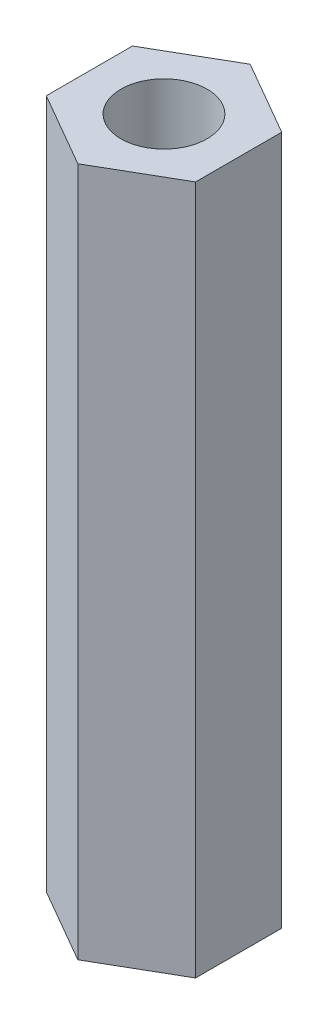
ISO-10303-21;
HEADER;
FILE_DESCRIPTION(('STEP AP214'),'2;1');
FILE_NAME('part.step','',(''),(''),'','','');
FILE_SCHEMA(('AUTOMOTIVE_DESIGN { 1 0 10303 214 1 1 1 1 }'));
ENDSEC;
DATA;
#1=APPLICATION_CONTEXT('core data for automotive mechanical design processes');
#2=APPLICATION_PROTOCOL_DEFINITION('international standard','automotive_design',2000,#1);
#3=PRODUCT_CONTEXT('',#1,'mechanical');
#4=PRODUCT('Part','Part','',(#3));
#5=PRODUCT_RELATED_PRODUCT_CATEGORY('part','',(#4));
#6=PRODUCT_DEFINITION_FORMATION('','',#4);
#7=PRODUCT_DEFINITION_CONTEXT('part definition',#1,'design');
#8=PRODUCT_DEFINITION('design','',#6,#7);
#9=PRODUCT_DEFINITION_SHAPE('','',#8);
#10=(LENGTH_UNIT() NAMED_UNIT(*) SI_UNIT(.MILLI.,.METRE.));
#11=(NAMED_UNIT(*) PLANE_ANGLE_UNIT() SI_UNIT($,.RADIAN.));
#12=(NAMED_UNIT(*) SI_UNIT($,.STERADIAN.) SOLID_ANGLE_UNIT());
#13=UNCERTAINTY_MEASURE_WITH_UNIT(LENGTH_MEASURE(1.E-05),#10,'distance_accuracy_value','');
#14=(GEOMETRIC_REPRESENTATION_CONTEXT(3) GLOBAL_UNCERTAINTY_ASSIGNED_CONTEXT((#13)) GLOBAL_UNIT_ASSIGNED_CONTEXT((#10,
#11,#12)) REPRESENTATION_CONTEXT('',''));
#15=CARTESIAN_POINT('',(0.,0.,0.));
#16=DIRECTION('',(0.,0.,1.));
#17=DIRECTION('',(1.,0.,0.));
#18=AXIS2_PLACEMENT_3D('',#15,#16,#17);
#19=CARTESIAN_POINT('',(0.,40.,-5.));
#20=DIRECTION('',(0.,1.,0.));
#21=DIRECTION('',(0.,0.,1.));
#22=AXIS2_PLACEMENT_3D('',#19,#20,#21);
#23=PLANE('',#22);
#24=DIRECTION('',(-0.866025403784439,0.,-0.5));
#25=VECTOR('',#24,1.);
#26=CARTESIAN_POINT('',(4.33012701892219,40.,-2.5));
#27=LINE('',#26,#25);
#28=CARTESIAN_POINT('',(4.33012701892219,40.,-2.5));
#29=VERTEX_POINT('',#28);
#30=CARTESIAN_POINT('',(0.,40.,-5.));
#31=VERTEX_POINT('',#30);
#32=EDGE_CURVE('E127',#29,#31,#27,.T.);
#33=ORIENTED_EDGE('',*,*,#32,.T.);
#34=DIRECTION('',(-0.866025403784439,0.,0.5));
#35=VECTOR('',#34,1.);
#36=CARTESIAN_POINT('',(0.,40.,-5.));
#37=LINE('',#36,#35);
#38=CARTESIAN_POINT('',(-4.33012701892219,40.,-2.5));
#39=VERTEX_POINT('',#38);
#40=EDGE_CURVE('E85',#31,#39,#37,.T.);
#41=ORIENTED_EDGE('',*,*,#40,.T.);
#42=DIRECTION('',(0.,0.,1.));
#43=VECTOR('',#42,1.);
#44=CARTESIAN_POINT('',(-4.33012701892219,40.,-2.5));
#45=LINE('',#44,#43);
#46=CARTESIAN_POINT('',(-4.33012701892219,40.,2.5));
#47=VERTEX_POINT('',#46);
#48=EDGE_CURVE('E98',#39,#47,#45,.T.);
#49=ORIENTED_EDGE('',*,*,#48,.T.);
#50=DIRECTION('',(0.866025403784439,0.,0.5));
#51=VECTOR('',#50,1.);
#52=CARTESIAN_POINT('',(-4.33012701892219,40.,2.5));
#53=LINE('',#52,#51);
#54=CARTESIAN_POINT('',(0.,40.,5.));
#55=VERTEX_POINT('',#54);
#56=EDGE_CURVE('E92',#47,#55,#53,.T.);
#57=ORIENTED_EDGE('',*,*,#56,.T.);
#58=DIRECTION('',(0.866025403784439,0.,-0.5));
#59=VECTOR('',#58,1.);
#60=CARTESIAN_POINT('',(0.,40.,5.));
#61=LINE('',#60,#59);
#62=CARTESIAN_POINT('',(4.33012701892219,40.,2.5));
#63=VERTEX_POINT('',#62);
#64=EDGE_CURVE('E96',#55,#63,#61,.T.);
#65=ORIENTED_EDGE('',*,*,#64,.T.);
#66=DIRECTION('',(0.,0.,-1.));
#67=VECTOR('',#66,1.);
#68=CARTESIAN_POINT('',(4.33012701892219,40.,2.5));
#69=LINE('',#68,#67);
#70=EDGE_CURVE('E48',#63,#29,#69,.T.);
#71=ORIENTED_EDGE('',*,*,#70,.T.);
#72=EDGE_LOOP('',(#33,#41,#49,#57,#65,#71));
#73=FACE_BOUND('',#72,.T.);
#74=CARTESIAN_POINT('',(0.,40.,0.));
#75=DIRECTION('',(0.,1.,0.));
#76=DIRECTION('',(0.,0.,1.));
#77=AXIS2_PLACEMENT_3D('',#74,#75,#76);
#78=CIRCLE('',#77,2.5);
#79=CARTESIAN_POINT('',(0.,40.,2.5));
#80=VERTEX_POINT('',#79);
#81=EDGE_CURVE('E120',#80,#80,#78,.T.);
#82=ORIENTED_EDGE('',*,*,#81,.F.);
#83=EDGE_LOOP('',(#82));
#84=FACE_BOUND('',#83,.T.);
#85=ADVANCED_FACE('F31',(#73,#84),#23,.T.);
#86=CARTESIAN_POINT('',(0.,0.,-5.));
#87=DIRECTION('',(0.,1.,0.));
#88=DIRECTION('',(0.,0.,1.));
#89=AXIS2_PLACEMENT_3D('',#86,#87,#88);
#90=PLANE('',#89);
#91=DIRECTION('',(-0.866025403784439,0.,-0.5));
#92=VECTOR('',#91,1.);
#93=CARTESIAN_POINT('',(4.33012701892219,0.,-2.5));
#94=LINE('',#93,#92);
#95=CARTESIAN_POINT('',(4.33012701892219,0.,-2.5));
#96=VERTEX_POINT('',#95);
#97=CARTESIAN_POINT('',(0.,0.,-5.));
#98=VERTEX_POINT('',#97);
#99=EDGE_CURVE('E116',#96,#98,#94,.T.);
#100=ORIENTED_EDGE('',*,*,#99,.F.);
#101=DIRECTION('',(0.,0.,-1.));
#102=VECTOR('',#101,1.);
#103=CARTESIAN_POINT('',(4.33012701892219,0.,2.5));
#104=LINE('',#103,#102);
#105=CARTESIAN_POINT('',(4.33012701892219,0.,2.5));
#106=VERTEX_POINT('',#105);
#107=EDGE_CURVE('E77',#106,#96,#104,.T.);
#108=ORIENTED_EDGE('',*,*,#107,.F.);
#109=DIRECTION('',(0.866025403784439,0.,-0.5));
#110=VECTOR('',#109,1.);
#111=CARTESIAN_POINT('',(0.,0.,5.));
#112=LINE('',#111,#110);
#113=CARTESIAN_POINT('',(0.,0.,5.));
#114=VERTEX_POINT('',#113);
#115=EDGE_CURVE('E71',#114,#106,#112,.T.);
#116=ORIENTED_EDGE('',*,*,#115,.F.);
#117=DIRECTION('',(0.866025403784439,0.,0.5));
#118=VECTOR('',#117,1.);
#119=CARTESIAN_POINT('',(-4.33012701892219,0.,2.5));
#120=LINE('',#119,#118);
#121=CARTESIAN_POINT('',(-4.33012701892219,0.,2.5));
#122=VERTEX_POINT('',#121);
#123=EDGE_CURVE('E106',#122,#114,#120,.T.);
#124=ORIENTED_EDGE('',*,*,#123,.F.);
#125=DIRECTION('',(0.,0.,1.));
#126=VECTOR('',#125,1.);
#127=CARTESIAN_POINT('',(-4.33012701892219,0.,-2.5));
#128=LINE('',#127,#126);
#129=CARTESIAN_POINT('',(-4.33012701892219,0.,-2.5));
#130=VERTEX_POINT('',#129);
#131=EDGE_CURVE('E122',#130,#122,#128,.T.);
#132=ORIENTED_EDGE('',*,*,#131,.F.);
#133=DIRECTION('',(-0.866025403784439,0.,0.5));
#134=VECTOR('',#133,1.);
#135=CARTESIAN_POINT('',(0.,0.,-5.));
#136=LINE('',#135,#134);
#137=EDGE_CURVE('E119',#98,#130,#136,.T.);
#138=ORIENTED_EDGE('',*,*,#137,.F.);
#139=EDGE_LOOP('',(#100,#108,#116,#124,#132,#138));
#140=FACE_BOUND('',#139,.T.);
#141=CARTESIAN_POINT('',(0.,0.,0.));
#142=DIRECTION('',(0.,1.,0.));
#143=DIRECTION('',(0.,0.,1.));
#144=AXIS2_PLACEMENT_3D('',#141,#142,#143);
#145=CIRCLE('',#144,2.5);
#146=CARTESIAN_POINT('',(0.,0.,2.5));
#147=VERTEX_POINT('',#146);
#148=EDGE_CURVE('E220',#147,#147,#145,.T.);
#149=ORIENTED_EDGE('',*,*,#148,.T.);
#150=EDGE_LOOP('',(#149));
#151=FACE_BOUND('',#150,.T.);
#152=ADVANCED_FACE('F136',(#140,#151),#90,.F.);
#153=CARTESIAN_POINT('',(4.33012701892219,40.,-2.5));
#154=DIRECTION('',(-0.5,0.,0.866025403784439));
#155=DIRECTION('',(0.866025403784439,0.,0.5));
#156=AXIS2_PLACEMENT_3D('',#153,#154,#155);
#157=PLANE('',#156);
#158=ORIENTED_EDGE('',*,*,#99,.T.);
#159=DIRECTION('',(0.,-1.,0.));
#160=VECTOR('',#159,1.);
#161=CARTESIAN_POINT('',(0.,40.,-5.));
#162=LINE('',#161,#160);
#163=EDGE_CURVE('E11',#31,#98,#162,.T.);
#164=ORIENTED_EDGE('',*,*,#163,.F.);
#165=ORIENTED_EDGE('',*,*,#32,.F.);
#166=DIRECTION('',(0.,-1.,0.));
#167=VECTOR('',#166,1.);
#168=CARTESIAN_POINT('',(4.33012701892219,40.,-2.5));
#169=LINE('',#168,#167);
#170=EDGE_CURVE('E112',#29,#96,#169,.T.);
#171=ORIENTED_EDGE('',*,*,#170,.T.);
#172=EDGE_LOOP('',(#158,#164,#165,#171));
#173=FACE_BOUND('',#172,.T.);
#174=ADVANCED_FACE('F33',(#173),#157,.F.);
#175=CARTESIAN_POINT('',(0.,40.,-5.));
#176=DIRECTION('',(0.5,0.,0.866025403784439));
#177=DIRECTION('',(0.866025403784439,0.,-0.5));
#178=AXIS2_PLACEMENT_3D('',#175,#176,#177);
#179=PLANE('',#178);
#180=ORIENTED_EDGE('',*,*,#137,.T.);
#181=DIRECTION('',(0.,-1.,0.));
#182=VECTOR('',#181,1.);
#183=CARTESIAN_POINT('',(-4.33012701892219,40.,-2.5));
#184=LINE('',#183,#182);
#185=EDGE_CURVE('E40',#39,#130,#184,.T.);
#186=ORIENTED_EDGE('',*,*,#185,.F.);
#187=ORIENTED_EDGE('',*,*,#40,.F.);
#188=ORIENTED_EDGE('',*,*,#163,.T.);
#189=EDGE_LOOP('',(#180,#186,#187,#188));
#190=FACE_BOUND('',#189,.T.);
#191=ADVANCED_FACE('F161',(#190),#179,.F.);
#192=CARTESIAN_POINT('',(-4.33012701892219,40.,-2.5));
#193=DIRECTION('',(1.,0.,0.));
#194=DIRECTION('',(0.,0.,-1.));
#195=AXIS2_PLACEMENT_3D('',#192,#193,#194);
#196=PLANE('',#195);
#197=ORIENTED_EDGE('',*,*,#131,.T.);
#198=DIRECTION('',(0.,-1.,0.));
#199=VECTOR('',#198,1.);
#200=CARTESIAN_POINT('',(-4.33012701892219,40.,2.5));
#201=LINE('',#200,#199);
#202=EDGE_CURVE('E107',#47,#122,#201,.T.);
#203=ORIENTED_EDGE('',*,*,#202,.F.);
#204=ORIENTED_EDGE('',*,*,#48,.F.);
#205=ORIENTED_EDGE('',*,*,#185,.T.);
#206=EDGE_LOOP('',(#197,#203,#204,#205));
#207=FACE_BOUND('',#206,.T.);
#208=ADVANCED_FACE('F133',(#207),#196,.F.);
#209=CARTESIAN_POINT('',(-4.33012701892219,40.,2.5));
#210=DIRECTION('',(0.5,0.,-0.866025403784439));
#211=DIRECTION('',(-0.866025403784439,0.,-0.5));
#212=AXIS2_PLACEMENT_3D('',#209,#210,#211);
#213=PLANE('',#212);
#214=ORIENTED_EDGE('',*,*,#123,.T.);
#215=DIRECTION('',(0.,-1.,0.));
#216=VECTOR('',#215,1.);
#217=CARTESIAN_POINT('',(0.,40.,5.));
#218=LINE('',#217,#216);
#219=EDGE_CURVE('E103',#55,#114,#218,.T.);
#220=ORIENTED_EDGE('',*,*,#219,.F.);
#221=ORIENTED_EDGE('',*,*,#56,.F.);
#222=ORIENTED_EDGE('',*,*,#202,.T.);
#223=EDGE_LOOP('',(#214,#220,#221,#222));
#224=FACE_BOUND('',#223,.T.);
#225=ADVANCED_FACE('F104',(#224),#213,.F.);
#226=CARTESIAN_POINT('',(0.,40.,5.));
#227=DIRECTION('',(-0.5,0.,-0.866025403784439));
#228=DIRECTION('',(-0.866025403784439,0.,0.5));
#229=AXIS2_PLACEMENT_3D('',#226,#227,#228);
#230=PLANE('',#229);
#231=ORIENTED_EDGE('',*,*,#115,.T.);
#232=DIRECTION('',(0.,-1.,0.));
#233=VECTOR('',#232,1.);
#234=CARTESIAN_POINT('',(4.33012701892219,40.,2.5));
#235=LINE('',#234,#233);
#236=EDGE_CURVE('E108',#63,#106,#235,.T.);
#237=ORIENTED_EDGE('',*,*,#236,.F.);
#238=ORIENTED_EDGE('',*,*,#64,.F.);
#239=ORIENTED_EDGE('',*,*,#219,.T.);
#240=EDGE_LOOP('',(#231,#237,#238,#239));
#241=FACE_BOUND('',#240,.T.);
#242=ADVANCED_FACE('F110',(#241),#230,.F.);
#243=CARTESIAN_POINT('',(4.33012701892219,40.,2.5));
#244=DIRECTION('',(-1.,0.,0.));
#245=DIRECTION('',(0.,0.,1.));
#246=AXIS2_PLACEMENT_3D('',#243,#244,#245);
#247=PLANE('',#246);
#248=ORIENTED_EDGE('',*,*,#107,.T.);
#249=ORIENTED_EDGE('',*,*,#170,.F.);
#250=ORIENTED_EDGE('',*,*,#70,.F.);
#251=ORIENTED_EDGE('',*,*,#236,.T.);
#252=EDGE_LOOP('',(#248,#249,#250,#251));
#253=FACE_BOUND('',#252,.T.);
#254=ADVANCED_FACE('F141',(#253),#247,.F.);
#255=CARTESIAN_POINT('',(0.,40.,0.));
#256=DIRECTION('',(0.,-1.,0.));
#257=DIRECTION('',(0.,0.,-1.));
#258=AXIS2_PLACEMENT_3D('',#255,#256,#257);
#259=CYLINDRICAL_SURFACE('',#258,2.5);
#260=ORIENTED_EDGE('',*,*,#81,.T.);
#261=EDGE_LOOP('',(#260));
#262=FACE_BOUND('',#261,.T.);
#263=ORIENTED_EDGE('',*,*,#148,.F.);
#264=EDGE_LOOP('',(#263));
#265=FACE_BOUND('',#264,.T.);
#266=ADVANCED_FACE('F143',(#262,#265),#259,.F.);
#267=CLOSED_SHELL('',(#85,#152,#174,#191,#208,#225,#242,#254,#266));
#268=MANIFOLD_SOLID_BREP('B2',#267);
#269=ADVANCED_BREP_SHAPE_REPRESENTATION('',(#18,#268),#14);
#270=SHAPE_DEFINITION_REPRESENTATION(#9,#269);
ENDSEC;
END-ISO-10303-21;
